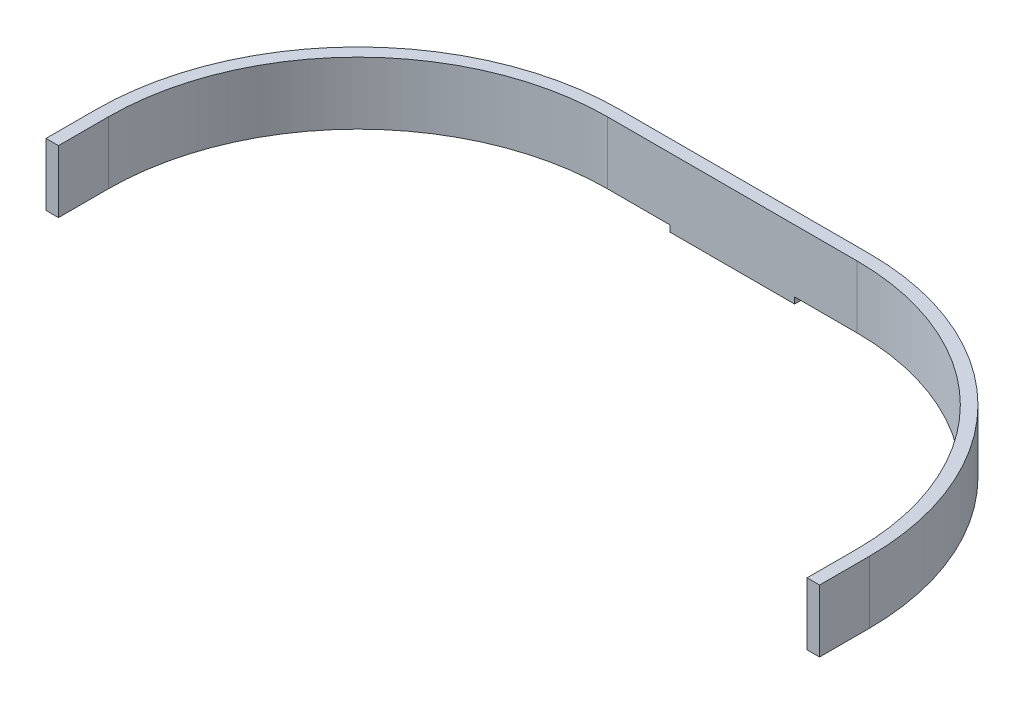
ISO-10303-21;
HEADER;
FILE_DESCRIPTION(('STEP AP214'),'2;1');
FILE_NAME('part.step','',(''),(''),'','','');
FILE_SCHEMA(('AUTOMOTIVE_DESIGN { 1 0 10303 214 1 1 1 1 }'));
ENDSEC;
DATA;
#1=APPLICATION_CONTEXT('core data for automotive mechanical design processes');
#2=APPLICATION_PROTOCOL_DEFINITION('international standard','automotive_design',2000,#1);
#3=PRODUCT_CONTEXT('',#1,'mechanical');
#4=PRODUCT('Part','Part','',(#3));
#5=PRODUCT_RELATED_PRODUCT_CATEGORY('part','',(#4));
#6=PRODUCT_DEFINITION_FORMATION('','',#4);
#7=PRODUCT_DEFINITION_CONTEXT('part definition',#1,'design');
#8=PRODUCT_DEFINITION('design','',#6,#7);
#9=PRODUCT_DEFINITION_SHAPE('','',#8);
#10=(LENGTH_UNIT() NAMED_UNIT(*) SI_UNIT(.MILLI.,.METRE.));
#11=(NAMED_UNIT(*) PLANE_ANGLE_UNIT() SI_UNIT($,.RADIAN.));
#12=(NAMED_UNIT(*) SI_UNIT($,.STERADIAN.) SOLID_ANGLE_UNIT());
#13=UNCERTAINTY_MEASURE_WITH_UNIT(LENGTH_MEASURE(1.E-05),#10,'distance_accuracy_value','');
#14=(GEOMETRIC_REPRESENTATION_CONTEXT(3) GLOBAL_UNCERTAINTY_ASSIGNED_CONTEXT((#13)) GLOBAL_UNIT_ASSIGNED_CONTEXT((#10,
#11,#12)) REPRESENTATION_CONTEXT('',''));
#15=CARTESIAN_POINT('',(0.,0.,0.));
#16=DIRECTION('',(0.,0.,1.));
#17=DIRECTION('',(1.,0.,0.));
#18=AXIS2_PLACEMENT_3D('',#15,#16,#17);
#19=CARTESIAN_POINT('',(20.,0.999999999999999,12.));
#20=DIRECTION('',(0.,0.,-1.));
#21=DIRECTION('',(0.,1.,0.));
#22=AXIS2_PLACEMENT_3D('',#19,#20,#21);
#23=PLANE('',#22);
#24=DIRECTION('',(0.,-1.,0.));
#25=VECTOR('',#24,1.);
#26=CARTESIAN_POINT('',(-20.,0.999999999999999,12.));
#27=LINE('',#26,#25);
#28=CARTESIAN_POINT('',(-20.,0.999999999999999,12.));
#29=VERTEX_POINT('',#28);
#30=CARTESIAN_POINT('',(-20.,-1.,12.));
#31=VERTEX_POINT('',#30);
#32=EDGE_CURVE('E117',#29,#31,#27,.T.);
#33=ORIENTED_EDGE('',*,*,#32,.T.);
#34=DIRECTION('',(-1.,0.,0.));
#35=VECTOR('',#34,1.);
#36=CARTESIAN_POINT('',(20.,-1.,12.));
#37=LINE('',#36,#35);
#38=CARTESIAN_POINT('',(20.,-1.,12.));
#39=VERTEX_POINT('',#38);
#40=EDGE_CURVE('E44',#39,#31,#37,.T.);
#41=ORIENTED_EDGE('',*,*,#40,.F.);
#42=DIRECTION('',(0.,-1.,0.));
#43=VECTOR('',#42,1.);
#44=CARTESIAN_POINT('',(20.,0.999999999999999,12.));
#45=LINE('',#44,#43);
#46=CARTESIAN_POINT('',(20.,0.999999999999999,12.));
#47=VERTEX_POINT('',#46);
#48=EDGE_CURVE('E101',#47,#39,#45,.T.);
#49=ORIENTED_EDGE('',*,*,#48,.F.);
#50=DIRECTION('',(1.,0.,0.));
#51=VECTOR('',#50,1.);
#52=CARTESIAN_POINT('',(-40.,0.999999999999999,12.));
#53=LINE('',#52,#51);
#54=CARTESIAN_POINT('',(40.,0.999999999999999,12.));
#55=VERTEX_POINT('',#54);
#56=EDGE_CURVE('E83',#47,#55,#53,.T.);
#57=ORIENTED_EDGE('',*,*,#56,.T.);
#58=DIRECTION('',(0.,-1.,0.));
#59=VECTOR('',#58,1.);
#60=CARTESIAN_POINT('',(40.,21.,12.));
#61=LINE('',#60,#59);
#62=CARTESIAN_POINT('',(40.,21.,12.));
#63=VERTEX_POINT('',#62);
#64=EDGE_CURVE('E163',#63,#55,#61,.T.);
#65=ORIENTED_EDGE('',*,*,#64,.F.);
#66=DIRECTION('',(1.,0.,0.));
#67=VECTOR('',#66,1.);
#68=CARTESIAN_POINT('',(-40.,21.,12.));
#69=LINE('',#68,#67);
#70=CARTESIAN_POINT('',(-40.,21.,12.));
#71=VERTEX_POINT('',#70);
#72=EDGE_CURVE('E314',#71,#63,#69,.T.);
#73=ORIENTED_EDGE('',*,*,#72,.F.);
#74=DIRECTION('',(0.,-1.,0.));
#75=VECTOR('',#74,1.);
#76=CARTESIAN_POINT('',(-40.,21.,12.));
#77=LINE('',#76,#75);
#78=CARTESIAN_POINT('',(-40.,0.999999999999999,12.));
#79=VERTEX_POINT('',#78);
#80=EDGE_CURVE('E165',#71,#79,#77,.T.);
#81=ORIENTED_EDGE('',*,*,#80,.T.);
#82=EDGE_CURVE('E97',#79,#29,#53,.T.);
#83=ORIENTED_EDGE('',*,*,#82,.T.);
#84=EDGE_LOOP('',(#33,#41,#49,#57,#65,#73,#81,#83));
#85=FACE_BOUND('',#84,.T.);
#86=ADVANCED_FACE('F36',(#85),#23,.F.);
#87=CARTESIAN_POINT('',(20.,-1.,10.));
#88=DIRECTION('',(0.,1.,0.));
#89=DIRECTION('',(0.,0.,1.));
#90=AXIS2_PLACEMENT_3D('',#87,#88,#89);
#91=PLANE('',#90);
#92=DIRECTION('',(0.,0.,-1.));
#93=VECTOR('',#92,1.);
#94=CARTESIAN_POINT('',(-20.,-1.,10.));
#95=LINE('',#94,#93);
#96=CARTESIAN_POINT('',(-20.,-1.,8.));
#97=VERTEX_POINT('',#96);
#98=EDGE_CURVE('E64',#31,#97,#95,.T.);
#99=ORIENTED_EDGE('',*,*,#98,.T.);
#100=DIRECTION('',(-1.,0.,0.));
#101=VECTOR('',#100,1.);
#102=CARTESIAN_POINT('',(20.,-1.,8.));
#103=LINE('',#102,#101);
#104=CARTESIAN_POINT('',(20.,-1.,8.));
#105=VERTEX_POINT('',#104);
#106=EDGE_CURVE('E116',#105,#97,#103,.T.);
#107=ORIENTED_EDGE('',*,*,#106,.F.);
#108=DIRECTION('',(0.,0.,-1.));
#109=VECTOR('',#108,1.);
#110=CARTESIAN_POINT('',(20.,-1.,10.));
#111=LINE('',#110,#109);
#112=EDGE_CURVE('E52',#39,#105,#111,.T.);
#113=ORIENTED_EDGE('',*,*,#112,.F.);
#114=ORIENTED_EDGE('',*,*,#40,.T.);
#115=EDGE_LOOP('',(#99,#107,#113,#114));
#116=FACE_BOUND('',#115,.T.);
#117=ADVANCED_FACE('F124',(#116),#91,.F.);
#118=CARTESIAN_POINT('',(20.,0.999999999999999,8.));
#119=DIRECTION('',(0.,0.,1.));
#120=DIRECTION('',(1.,0.,0.));
#121=AXIS2_PLACEMENT_3D('',#118,#119,#120);
#122=PLANE('',#121);
#123=CARTESIAN_POINT('',(0.,11.,8.));
#124=DIRECTION('',(0.,0.,1.));
#125=DIRECTION('',(1.,0.,0.));
#126=AXIS2_PLACEMENT_3D('',#123,#124,#125);
#127=CIRCLE('',#126,6.);
#128=CARTESIAN_POINT('',(6.,11.,8.));
#129=VERTEX_POINT('',#128);
#130=EDGE_CURVE('E11',#129,#129,#127,.F.);
#131=ORIENTED_EDGE('',*,*,#130,.F.);
#132=EDGE_LOOP('',(#131));
#133=FACE_BOUND('',#132,.T.);
#134=DIRECTION('',(0.,1.,0.));
#135=VECTOR('',#134,1.);
#136=CARTESIAN_POINT('',(-20.,0.999999999999999,8.));
#137=LINE('',#136,#135);
#138=CARTESIAN_POINT('',(-20.,0.999999999999999,8.00000000000001));
#139=VERTEX_POINT('',#138);
#140=EDGE_CURVE('E108',#97,#139,#137,.T.);
#141=ORIENTED_EDGE('',*,*,#140,.T.);
#142=DIRECTION('',(-1.,0.,0.));
#143=VECTOR('',#142,1.);
#144=CARTESIAN_POINT('',(-40.,0.999999999999999,8.00000000000001));
#145=LINE('',#144,#143);
#146=CARTESIAN_POINT('',(-40.,0.999999999999999,8.00000000000001));
#147=VERTEX_POINT('',#146);
#148=EDGE_CURVE('E136',#139,#147,#145,.T.);
#149=ORIENTED_EDGE('',*,*,#148,.T.);
#150=DIRECTION('',(0.,-1.,0.));
#151=VECTOR('',#150,1.);
#152=CARTESIAN_POINT('',(-40.,21.,8.00000000000001));
#153=LINE('',#152,#151);
#154=CARTESIAN_POINT('',(-40.,21.,8.00000000000001));
#155=VERTEX_POINT('',#154);
#156=EDGE_CURVE('E146',#155,#147,#153,.T.);
#157=ORIENTED_EDGE('',*,*,#156,.F.);
#158=DIRECTION('',(-1.,0.,0.));
#159=VECTOR('',#158,1.);
#160=CARTESIAN_POINT('',(-40.,21.,8.00000000000001));
#161=LINE('',#160,#159);
#162=CARTESIAN_POINT('',(40.,21.,8.00000000000001));
#163=VERTEX_POINT('',#162);
#164=EDGE_CURVE('E149',#163,#155,#161,.T.);
#165=ORIENTED_EDGE('',*,*,#164,.F.);
#166=DIRECTION('',(0.,-1.,0.));
#167=VECTOR('',#166,1.);
#168=CARTESIAN_POINT('',(40.,21.,8.00000000000001));
#169=LINE('',#168,#167);
#170=CARTESIAN_POINT('',(40.,0.999999999999999,8.00000000000001));
#171=VERTEX_POINT('',#170);
#172=EDGE_CURVE('E132',#163,#171,#169,.T.);
#173=ORIENTED_EDGE('',*,*,#172,.T.);
#174=CARTESIAN_POINT('',(20.,0.999999999999999,8.00000000000001));
#175=VERTEX_POINT('',#174);
#176=EDGE_CURVE('E128',#171,#175,#145,.T.);
#177=ORIENTED_EDGE('',*,*,#176,.T.);
#178=DIRECTION('',(0.,1.,0.));
#179=VECTOR('',#178,1.);
#180=CARTESIAN_POINT('',(20.,0.999999999999999,8.));
#181=LINE('',#180,#179);
#182=EDGE_CURVE('E106',#105,#175,#181,.T.);
#183=ORIENTED_EDGE('',*,*,#182,.F.);
#184=ORIENTED_EDGE('',*,*,#106,.T.);
#185=EDGE_LOOP('',(#141,#149,#157,#165,#173,#177,#183,#184));
#186=FACE_BOUND('',#185,.T.);
#187=ADVANCED_FACE('F126',(#133,#186),#122,.F.);
#188=CARTESIAN_POINT('',(20.,0.,0.));
#189=DIRECTION('',(1.,0.,0.));
#190=DIRECTION('',(0.,0.,-1.));
#191=AXIS2_PLACEMENT_3D('',#188,#189,#190);
#192=PLANE('',#191);
#193=DIRECTION('',(0.,0.,1.));
#194=VECTOR('',#193,1.);
#195=CARTESIAN_POINT('',(20.,0.999999999999999,9.99999999999999));
#196=LINE('',#195,#194);
#197=EDGE_CURVE('E88',#175,#47,#196,.T.);
#198=ORIENTED_EDGE('',*,*,#197,.T.);
#199=ORIENTED_EDGE('',*,*,#48,.T.);
#200=ORIENTED_EDGE('',*,*,#112,.T.);
#201=ORIENTED_EDGE('',*,*,#182,.T.);
#202=EDGE_LOOP('',(#198,#199,#200,#201));
#203=FACE_BOUND('',#202,.T.);
#204=ADVANCED_FACE('F104',(#203),#192,.T.);
#205=CARTESIAN_POINT('',(-20.,0.,0.));
#206=DIRECTION('',(1.,0.,0.));
#207=DIRECTION('',(0.,0.,-1.));
#208=AXIS2_PLACEMENT_3D('',#205,#206,#207);
#209=PLANE('',#208);
#210=ORIENTED_EDGE('',*,*,#32,.F.);
#211=DIRECTION('',(0.,0.,1.));
#212=VECTOR('',#211,1.);
#213=CARTESIAN_POINT('',(-20.,0.999999999999999,9.99999999999999));
#214=LINE('',#213,#212);
#215=EDGE_CURVE('E73',#139,#29,#214,.T.);
#216=ORIENTED_EDGE('',*,*,#215,.F.);
#217=ORIENTED_EDGE('',*,*,#140,.F.);
#218=ORIENTED_EDGE('',*,*,#98,.F.);
#219=EDGE_LOOP('',(#210,#216,#217,#218));
#220=FACE_BOUND('',#219,.T.);
#221=ADVANCED_FACE('F347',(#220),#209,.F.);
#222=CARTESIAN_POINT('',(-40.,0.999999999999996,92.));
#223=DIRECTION('',(0.,1.,0.));
#224=DIRECTION('',(0.,0.,1.));
#225=AXIS2_PLACEMENT_3D('',#222,#223,#224);
#226=PLANE('',#225);
#227=ORIENTED_EDGE('',*,*,#148,.F.);
#228=ORIENTED_EDGE('',*,*,#215,.T.);
#229=ORIENTED_EDGE('',*,*,#82,.F.);
#230=CARTESIAN_POINT('',(-40.,0.999999999999996,92.));
#231=DIRECTION('',(0.,-1.,0.));
#232=DIRECTION('',(0.,0.,1.));
#233=AXIS2_PLACEMENT_3D('',#230,#231,#232);
#234=CIRCLE('',#233,80.);
#235=CARTESIAN_POINT('',(-120.,0.999999999999996,92.));
#236=VERTEX_POINT('',#235);
#237=EDGE_CURVE('E98',#236,#79,#234,.T.);
#238=ORIENTED_EDGE('',*,*,#237,.F.);
#239=DIRECTION('',(0.,0.,-1.));
#240=VECTOR('',#239,1.);
#241=CARTESIAN_POINT('',(-120.,0.999999999999996,92.));
#242=LINE('',#241,#240);
#243=CARTESIAN_POINT('',(-120.,0.999999999999995,108.));
#244=VERTEX_POINT('',#243);
#245=EDGE_CURVE('E211',#244,#236,#242,.T.);
#246=ORIENTED_EDGE('',*,*,#245,.F.);
#247=DIRECTION('',(1.,0.,0.));
#248=VECTOR('',#247,1.);
#249=CARTESIAN_POINT('',(-124.,0.999999999999995,108.));
#250=LINE('',#249,#248);
#251=CARTESIAN_POINT('',(-124.,0.999999999999995,108.));
#252=VERTEX_POINT('',#251);
#253=EDGE_CURVE('E203',#252,#244,#250,.T.);
#254=ORIENTED_EDGE('',*,*,#253,.F.);
#255=DIRECTION('',(0.,0.,1.));
#256=VECTOR('',#255,1.);
#257=CARTESIAN_POINT('',(-124.,0.999999999999996,92.));
#258=LINE('',#257,#256);
#259=CARTESIAN_POINT('',(-124.,0.999999999999996,92.));
#260=VERTEX_POINT('',#259);
#261=EDGE_CURVE('E190',#260,#252,#258,.T.);
#262=ORIENTED_EDGE('',*,*,#261,.F.);
#263=CARTESIAN_POINT('',(-40.,0.999999999999996,92.));
#264=DIRECTION('',(0.,1.,0.));
#265=DIRECTION('',(0.,0.,1.));
#266=AXIS2_PLACEMENT_3D('',#263,#264,#265);
#267=CIRCLE('',#266,84.);
#268=EDGE_CURVE('E197',#147,#260,#267,.T.);
#269=ORIENTED_EDGE('',*,*,#268,.F.);
#270=EDGE_LOOP('',(#227,#228,#229,#238,#246,#254,#262,#269));
#271=FACE_BOUND('',#270,.T.);
#272=ADVANCED_FACE('F323',(#271),#226,.F.);
#273=CARTESIAN_POINT('',(-40.,21.,92.));
#274=DIRECTION('',(0.,-1.,0.));
#275=DIRECTION('',(0.,0.,-1.));
#276=AXIS2_PLACEMENT_3D('',#273,#274,#275);
#277=CYLINDRICAL_SURFACE('',#276,84.);
#278=ORIENTED_EDGE('',*,*,#268,.T.);
#279=DIRECTION('',(0.,-1.,0.));
#280=VECTOR('',#279,1.);
#281=CARTESIAN_POINT('',(-124.,21.,92.));
#282=LINE('',#281,#280);
#283=CARTESIAN_POINT('',(-124.,21.,92.));
#284=VERTEX_POINT('',#283);
#285=EDGE_CURVE('E111',#284,#260,#282,.T.);
#286=ORIENTED_EDGE('',*,*,#285,.F.);
#287=CARTESIAN_POINT('',(-40.,21.,92.));
#288=DIRECTION('',(0.,1.,0.));
#289=DIRECTION('',(0.,0.,1.));
#290=AXIS2_PLACEMENT_3D('',#287,#288,#289);
#291=CIRCLE('',#290,84.);
#292=EDGE_CURVE('E135',#155,#284,#291,.T.);
#293=ORIENTED_EDGE('',*,*,#292,.F.);
#294=ORIENTED_EDGE('',*,*,#156,.T.);
#295=EDGE_LOOP('',(#278,#286,#293,#294));
#296=FACE_BOUND('',#295,.T.);
#297=ADVANCED_FACE('F198',(#296),#277,.T.);
#298=CARTESIAN_POINT('',(-124.,21.,92.));
#299=DIRECTION('',(1.,0.,0.));
#300=DIRECTION('',(0.,0.,-1.));
#301=AXIS2_PLACEMENT_3D('',#298,#299,#300);
#302=PLANE('',#301);
#303=ORIENTED_EDGE('',*,*,#261,.T.);
#304=DIRECTION('',(0.,-1.,0.));
#305=VECTOR('',#304,1.);
#306=CARTESIAN_POINT('',(-124.,21.,108.));
#307=LINE('',#306,#305);
#308=CARTESIAN_POINT('',(-124.,21.,108.));
#309=VERTEX_POINT('',#308);
#310=EDGE_CURVE('E173',#309,#252,#307,.T.);
#311=ORIENTED_EDGE('',*,*,#310,.F.);
#312=DIRECTION('',(0.,0.,1.));
#313=VECTOR('',#312,1.);
#314=CARTESIAN_POINT('',(-124.,21.,92.));
#315=LINE('',#314,#313);
#316=EDGE_CURVE('E139',#284,#309,#315,.T.);
#317=ORIENTED_EDGE('',*,*,#316,.F.);
#318=ORIENTED_EDGE('',*,*,#285,.T.);
#319=EDGE_LOOP('',(#303,#311,#317,#318));
#320=FACE_BOUND('',#319,.T.);
#321=ADVANCED_FACE('F188',(#320),#302,.F.);
#322=CARTESIAN_POINT('',(-124.,21.,108.));
#323=DIRECTION('',(0.,0.,-1.));
#324=DIRECTION('',(0.,1.,0.));
#325=AXIS2_PLACEMENT_3D('',#322,#323,#324);
#326=PLANE('',#325);
#327=ORIENTED_EDGE('',*,*,#253,.T.);
#328=DIRECTION('',(0.,-1.,0.));
#329=VECTOR('',#328,1.);
#330=CARTESIAN_POINT('',(-120.,21.,108.));
#331=LINE('',#330,#329);
#332=CARTESIAN_POINT('',(-120.,21.,108.));
#333=VERTEX_POINT('',#332);
#334=EDGE_CURVE('E171',#333,#244,#331,.T.);
#335=ORIENTED_EDGE('',*,*,#334,.F.);
#336=DIRECTION('',(1.,0.,0.));
#337=VECTOR('',#336,1.);
#338=CARTESIAN_POINT('',(-124.,21.,108.));
#339=LINE('',#338,#337);
#340=EDGE_CURVE('E303',#309,#333,#339,.T.);
#341=ORIENTED_EDGE('',*,*,#340,.F.);
#342=ORIENTED_EDGE('',*,*,#310,.T.);
#343=EDGE_LOOP('',(#327,#335,#341,#342));
#344=FACE_BOUND('',#343,.T.);
#345=ADVANCED_FACE('F306',(#344),#326,.F.);
#346=CARTESIAN_POINT('',(-120.,21.,92.));
#347=DIRECTION('',(-1.,0.,0.));
#348=DIRECTION('',(0.,0.,1.));
#349=AXIS2_PLACEMENT_3D('',#346,#347,#348);
#350=PLANE('',#349);
#351=ORIENTED_EDGE('',*,*,#245,.T.);
#352=DIRECTION('',(0.,-1.,0.));
#353=VECTOR('',#352,1.);
#354=CARTESIAN_POINT('',(-120.,21.,92.));
#355=LINE('',#354,#353);
#356=CARTESIAN_POINT('',(-120.,21.,92.));
#357=VERTEX_POINT('',#356);
#358=EDGE_CURVE('E168',#357,#236,#355,.T.);
#359=ORIENTED_EDGE('',*,*,#358,.F.);
#360=DIRECTION('',(0.,0.,-1.));
#361=VECTOR('',#360,1.);
#362=CARTESIAN_POINT('',(-120.,21.,92.));
#363=LINE('',#362,#361);
#364=EDGE_CURVE('E308',#333,#357,#363,.T.);
#365=ORIENTED_EDGE('',*,*,#364,.F.);
#366=ORIENTED_EDGE('',*,*,#334,.T.);
#367=EDGE_LOOP('',(#351,#359,#365,#366));
#368=FACE_BOUND('',#367,.T.);
#369=ADVANCED_FACE('F328',(#368),#350,.F.);
#370=CARTESIAN_POINT('',(-40.,21.,92.));
#371=DIRECTION('',(0.,-1.,0.));
#372=DIRECTION('',(0.,0.,-1.));
#373=AXIS2_PLACEMENT_3D('',#370,#371,#372);
#374=CYLINDRICAL_SURFACE('',#373,80.);
#375=ORIENTED_EDGE('',*,*,#237,.T.);
#376=ORIENTED_EDGE('',*,*,#80,.F.);
#377=CARTESIAN_POINT('',(-40.,21.,92.));
#378=DIRECTION('',(0.,-1.,0.));
#379=DIRECTION('',(0.,0.,1.));
#380=AXIS2_PLACEMENT_3D('',#377,#378,#379);
#381=CIRCLE('',#380,80.);
#382=EDGE_CURVE('E310',#357,#71,#381,.T.);
#383=ORIENTED_EDGE('',*,*,#382,.F.);
#384=ORIENTED_EDGE('',*,*,#358,.T.);
#385=EDGE_LOOP('',(#375,#376,#383,#384));
#386=FACE_BOUND('',#385,.T.);
#387=ADVANCED_FACE('F325',(#386),#374,.F.);
#388=CARTESIAN_POINT('',(40.,21.,92.));
#389=DIRECTION('',(0.,-1.,0.));
#390=DIRECTION('',(0.,0.,-1.));
#391=AXIS2_PLACEMENT_3D('',#388,#389,#390);
#392=CYLINDRICAL_SURFACE('',#391,80.);
#393=CARTESIAN_POINT('',(40.,0.999999999999996,92.));
#394=DIRECTION('',(0.,-1.,0.));
#395=DIRECTION('',(0.,0.,1.));
#396=AXIS2_PLACEMENT_3D('',#393,#394,#395);
#397=CIRCLE('',#396,80.);
#398=CARTESIAN_POINT('',(120.,0.999999999999996,92.));
#399=VERTEX_POINT('',#398);
#400=EDGE_CURVE('E93',#55,#399,#397,.T.);
#401=ORIENTED_EDGE('',*,*,#400,.T.);
#402=DIRECTION('',(0.,-1.,0.));
#403=VECTOR('',#402,1.);
#404=CARTESIAN_POINT('',(120.,21.,92.));
#405=LINE('',#404,#403);
#406=CARTESIAN_POINT('',(120.,21.,92.));
#407=VERTEX_POINT('',#406);
#408=EDGE_CURVE('E160',#407,#399,#405,.T.);
#409=ORIENTED_EDGE('',*,*,#408,.F.);
#410=CARTESIAN_POINT('',(40.,21.,92.));
#411=DIRECTION('',(0.,-1.,0.));
#412=DIRECTION('',(0.,0.,1.));
#413=AXIS2_PLACEMENT_3D('',#410,#411,#412);
#414=CIRCLE('',#413,80.);
#415=EDGE_CURVE('E299',#63,#407,#414,.T.);
#416=ORIENTED_EDGE('',*,*,#415,.F.);
#417=ORIENTED_EDGE('',*,*,#64,.T.);
#418=EDGE_LOOP('',(#401,#409,#416,#417));
#419=FACE_BOUND('',#418,.T.);
#420=ADVANCED_FACE('F318',(#419),#392,.F.);
#421=CARTESIAN_POINT('',(120.,21.,92.));
#422=DIRECTION('',(1.,0.,0.));
#423=DIRECTION('',(0.,0.,-1.));
#424=AXIS2_PLACEMENT_3D('',#421,#422,#423);
#425=PLANE('',#424);
#426=DIRECTION('',(0.,0.,1.));
#427=VECTOR('',#426,1.);
#428=CARTESIAN_POINT('',(120.,0.999999999999996,92.));
#429=LINE('',#428,#427);
#430=CARTESIAN_POINT('',(120.,0.999999999999995,108.));
#431=VERTEX_POINT('',#430);
#432=EDGE_CURVE('E217',#399,#431,#429,.T.);
#433=ORIENTED_EDGE('',*,*,#432,.T.);
#434=DIRECTION('',(0.,-1.,0.));
#435=VECTOR('',#434,1.);
#436=CARTESIAN_POINT('',(120.,21.,108.));
#437=LINE('',#436,#435);
#438=CARTESIAN_POINT('',(120.,21.,108.));
#439=VERTEX_POINT('',#438);
#440=EDGE_CURVE('E157',#439,#431,#437,.T.);
#441=ORIENTED_EDGE('',*,*,#440,.F.);
#442=DIRECTION('',(0.,0.,1.));
#443=VECTOR('',#442,1.);
#444=CARTESIAN_POINT('',(120.,21.,92.));
#445=LINE('',#444,#443);
#446=EDGE_CURVE('E295',#407,#439,#445,.T.);
#447=ORIENTED_EDGE('',*,*,#446,.F.);
#448=ORIENTED_EDGE('',*,*,#408,.T.);
#449=EDGE_LOOP('',(#433,#441,#447,#448));
#450=FACE_BOUND('',#449,.T.);
#451=ADVANCED_FACE('F284',(#450),#425,.F.);
#452=CARTESIAN_POINT('',(120.,21.,108.));
#453=DIRECTION('',(0.,0.,-1.));
#454=DIRECTION('',(0.,1.,0.));
#455=AXIS2_PLACEMENT_3D('',#452,#453,#454);
#456=PLANE('',#455);
#457=DIRECTION('',(1.,0.,0.));
#458=VECTOR('',#457,1.);
#459=CARTESIAN_POINT('',(120.,0.999999999999995,108.));
#460=LINE('',#459,#458);
#461=CARTESIAN_POINT('',(124.,0.999999999999995,108.));
#462=VERTEX_POINT('',#461);
#463=EDGE_CURVE('E220',#431,#462,#460,.T.);
#464=ORIENTED_EDGE('',*,*,#463,.T.);
#465=DIRECTION('',(0.,-1.,0.));
#466=VECTOR('',#465,1.);
#467=CARTESIAN_POINT('',(124.,21.,108.));
#468=LINE('',#467,#466);
#469=CARTESIAN_POINT('',(124.,21.,108.));
#470=VERTEX_POINT('',#469);
#471=EDGE_CURVE('E154',#470,#462,#468,.T.);
#472=ORIENTED_EDGE('',*,*,#471,.F.);
#473=DIRECTION('',(1.,0.,0.));
#474=VECTOR('',#473,1.);
#475=CARTESIAN_POINT('',(120.,21.,108.));
#476=LINE('',#475,#474);
#477=EDGE_CURVE('E291',#439,#470,#476,.T.);
#478=ORIENTED_EDGE('',*,*,#477,.F.);
#479=ORIENTED_EDGE('',*,*,#440,.T.);
#480=EDGE_LOOP('',(#464,#472,#478,#479));
#481=FACE_BOUND('',#480,.T.);
#482=ADVANCED_FACE('F289',(#481),#456,.F.);
#483=CARTESIAN_POINT('',(124.,21.,92.));
#484=DIRECTION('',(-1.,0.,0.));
#485=DIRECTION('',(0.,0.,1.));
#486=AXIS2_PLACEMENT_3D('',#483,#484,#485);
#487=PLANE('',#486);
#488=DIRECTION('',(0.,0.,-1.));
#489=VECTOR('',#488,1.);
#490=CARTESIAN_POINT('',(124.,0.999999999999996,92.));
#491=LINE('',#490,#489);
#492=CARTESIAN_POINT('',(124.,0.999999999999996,92.));
#493=VERTEX_POINT('',#492);
#494=EDGE_CURVE('E222',#462,#493,#491,.T.);
#495=ORIENTED_EDGE('',*,*,#494,.T.);
#496=DIRECTION('',(0.,-1.,0.));
#497=VECTOR('',#496,1.);
#498=CARTESIAN_POINT('',(124.,21.,92.));
#499=LINE('',#498,#497);
#500=CARTESIAN_POINT('',(124.,21.,92.));
#501=VERTEX_POINT('',#500);
#502=EDGE_CURVE('E151',#501,#493,#499,.T.);
#503=ORIENTED_EDGE('',*,*,#502,.F.);
#504=DIRECTION('',(0.,0.,-1.));
#505=VECTOR('',#504,1.);
#506=CARTESIAN_POINT('',(124.,21.,92.));
#507=LINE('',#506,#505);
#508=EDGE_CURVE('E294',#470,#501,#507,.T.);
#509=ORIENTED_EDGE('',*,*,#508,.F.);
#510=ORIENTED_EDGE('',*,*,#471,.T.);
#511=EDGE_LOOP('',(#495,#503,#509,#510));
#512=FACE_BOUND('',#511,.T.);
#513=ADVANCED_FACE('F399',(#512),#487,.F.);
#514=CARTESIAN_POINT('',(40.,21.,92.));
#515=DIRECTION('',(0.,-1.,0.));
#516=DIRECTION('',(0.,0.,-1.));
#517=AXIS2_PLACEMENT_3D('',#514,#515,#516);
#518=CYLINDRICAL_SURFACE('',#517,84.);
#519=CARTESIAN_POINT('',(40.,0.999999999999996,92.));
#520=DIRECTION('',(0.,1.,0.));
#521=DIRECTION('',(0.,0.,1.));
#522=AXIS2_PLACEMENT_3D('',#519,#520,#521);
#523=CIRCLE('',#522,84.);
#524=EDGE_CURVE('E142',#493,#171,#523,.T.);
#525=ORIENTED_EDGE('',*,*,#524,.T.);
#526=ORIENTED_EDGE('',*,*,#172,.F.);
#527=CARTESIAN_POINT('',(40.,21.,92.));
#528=DIRECTION('',(0.,1.,0.));
#529=DIRECTION('',(0.,0.,1.));
#530=AXIS2_PLACEMENT_3D('',#527,#528,#529);
#531=CIRCLE('',#530,84.);
#532=EDGE_CURVE('E297',#501,#163,#531,.T.);
#533=ORIENTED_EDGE('',*,*,#532,.F.);
#534=ORIENTED_EDGE('',*,*,#502,.T.);
#535=EDGE_LOOP('',(#525,#526,#533,#534));
#536=FACE_BOUND('',#535,.T.);
#537=ADVANCED_FACE('F230',(#536),#518,.T.);
#538=CARTESIAN_POINT('',(-40.,21.,92.));
#539=DIRECTION('',(0.,1.,0.));
#540=DIRECTION('',(0.,0.,1.));
#541=AXIS2_PLACEMENT_3D('',#538,#539,#540);
#542=PLANE('',#541);
#543=ORIENTED_EDGE('',*,*,#292,.T.);
#544=ORIENTED_EDGE('',*,*,#316,.T.);
#545=ORIENTED_EDGE('',*,*,#340,.T.);
#546=ORIENTED_EDGE('',*,*,#364,.T.);
#547=ORIENTED_EDGE('',*,*,#382,.T.);
#548=ORIENTED_EDGE('',*,*,#72,.T.);
#549=ORIENTED_EDGE('',*,*,#415,.T.);
#550=ORIENTED_EDGE('',*,*,#446,.T.);
#551=ORIENTED_EDGE('',*,*,#477,.T.);
#552=ORIENTED_EDGE('',*,*,#508,.T.);
#553=ORIENTED_EDGE('',*,*,#532,.T.);
#554=ORIENTED_EDGE('',*,*,#164,.T.);
#555=EDGE_LOOP('',(#543,#544,#545,#546,#547,#548,#549,#550,#551,#552,#553,#554));
#556=FACE_BOUND('',#555,.T.);
#557=ADVANCED_FACE('F302',(#556),#542,.T.);
#558=ORIENTED_EDGE('',*,*,#197,.F.);
#559=ORIENTED_EDGE('',*,*,#176,.F.);
#560=ORIENTED_EDGE('',*,*,#524,.F.);
#561=ORIENTED_EDGE('',*,*,#494,.F.);
#562=ORIENTED_EDGE('',*,*,#463,.F.);
#563=ORIENTED_EDGE('',*,*,#432,.F.);
#564=ORIENTED_EDGE('',*,*,#400,.F.);
#565=ORIENTED_EDGE('',*,*,#56,.F.);
#566=EDGE_LOOP('',(#558,#559,#560,#561,#562,#563,#564,#565));
#567=FACE_BOUND('',#566,.T.);
#568=ADVANCED_FACE('F85',(#567),#226,.F.);
#569=CARTESIAN_POINT('',(0.,11.,4.));
#570=DIRECTION('',(0.,0.,1.));
#571=DIRECTION('',(1.,0.,0.));
#572=AXIS2_PLACEMENT_3D('',#569,#570,#571);
#573=CYLINDRICAL_SURFACE('',#572,6.);
#574=CARTESIAN_POINT('',(0.,11.,4.));
#575=DIRECTION('',(0.,0.,-1.));
#576=DIRECTION('',(-1.,0.,0.));
#577=AXIS2_PLACEMENT_3D('',#574,#575,#576);
#578=CIRCLE('',#577,6.);
#579=CARTESIAN_POINT('',(-6.,11.,4.));
#580=VERTEX_POINT('',#579);
#581=EDGE_CURVE('E201',#580,#580,#578,.T.);
#582=ORIENTED_EDGE('',*,*,#581,.F.);
#583=EDGE_LOOP('',(#582));
#584=FACE_BOUND('',#583,.T.);
#585=ORIENTED_EDGE('',*,*,#130,.T.);
#586=EDGE_LOOP('',(#585));
#587=FACE_BOUND('',#586,.T.);
#588=ADVANCED_FACE('F432',(#584,#587),#573,.T.);
#589=CARTESIAN_POINT('',(0.,11.,4.));
#590=DIRECTION('',(0.,0.,-1.));
#591=DIRECTION('',(-1.,0.,0.));
#592=AXIS2_PLACEMENT_3D('',#589,#590,#591);
#593=PLANE('',#592);
#594=ORIENTED_EDGE('',*,*,#581,.T.);
#595=EDGE_LOOP('',(#594));
#596=FACE_BOUND('',#595,.T.);
#597=ADVANCED_FACE('F450',(#596),#593,.T.);
#598=CLOSED_SHELL('',(#86,#117,#187,#204,#221,#272,#297,#321,#345,#369,#387,#420,#451,#482,#513,
#537,#557,#568,#588,#597));
#599=MANIFOLD_SOLID_BREP('B2',#598);
#600=ADVANCED_BREP_SHAPE_REPRESENTATION('',(#18,#599),#14);
#601=SHAPE_DEFINITION_REPRESENTATION(#9,#600);
ENDSEC;
END-ISO-10303-21;
